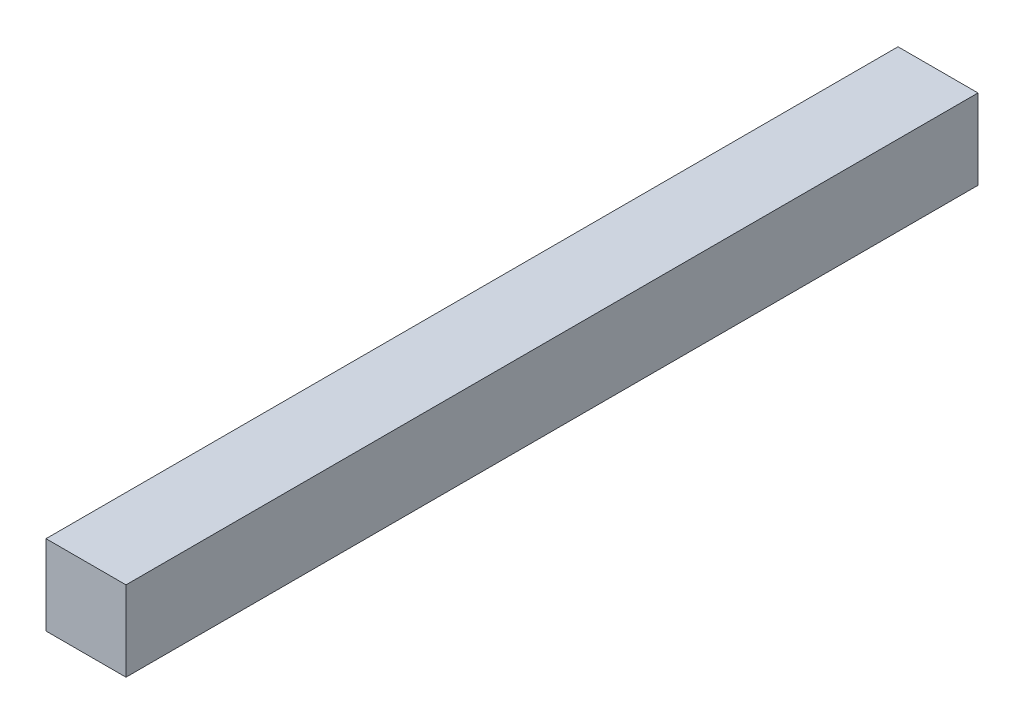
ISO-10303-21;
HEADER;
FILE_DESCRIPTION(('STEP AP214'),'2;1');
FILE_NAME('part.step','',(''),(''),'','','');
FILE_SCHEMA(('AUTOMOTIVE_DESIGN { 1 0 10303 214 1 1 1 1 }'));
ENDSEC;
DATA;
#1=APPLICATION_CONTEXT('core data for automotive mechanical design processes');
#2=APPLICATION_PROTOCOL_DEFINITION('international standard','automotive_design',2000,#1);
#3=PRODUCT_CONTEXT('',#1,'mechanical');
#4=PRODUCT('Part','Part','',(#3));
#5=PRODUCT_RELATED_PRODUCT_CATEGORY('part','',(#4));
#6=PRODUCT_DEFINITION_FORMATION('','',#4);
#7=PRODUCT_DEFINITION_CONTEXT('part definition',#1,'design');
#8=PRODUCT_DEFINITION('design','',#6,#7);
#9=PRODUCT_DEFINITION_SHAPE('','',#8);
#10=(LENGTH_UNIT() NAMED_UNIT(*) SI_UNIT(.MILLI.,.METRE.));
#11=(NAMED_UNIT(*) PLANE_ANGLE_UNIT() SI_UNIT($,.RADIAN.));
#12=(NAMED_UNIT(*) SI_UNIT($,.STERADIAN.) SOLID_ANGLE_UNIT());
#13=UNCERTAINTY_MEASURE_WITH_UNIT(LENGTH_MEASURE(1.E-05),#10,'distance_accuracy_value','');
#14=(GEOMETRIC_REPRESENTATION_CONTEXT(3) GLOBAL_UNCERTAINTY_ASSIGNED_CONTEXT((#13)) GLOBAL_UNIT_ASSIGNED_CONTEXT((#10,
#11,#12)) REPRESENTATION_CONTEXT('',''));
#15=CARTESIAN_POINT('',(0.,0.,0.));
#16=DIRECTION('',(0.,0.,1.));
#17=DIRECTION('',(1.,0.,0.));
#18=AXIS2_PLACEMENT_3D('',#15,#16,#17);
#19=CARTESIAN_POINT('',(0.,-2.539999996998E-06,0.));
#20=DIRECTION('',(-1.,0.,0.));
#21=DIRECTION('',(0.,0.,1.));
#22=AXIS2_PLACEMENT_3D('',#19,#20,#21);
#23=PLANE('',#22);
#24=DIRECTION('',(0.,0.,-1.));
#25=VECTOR('',#24,1.);
#26=CARTESIAN_POINT('',(0.,0.009999980000003,0.));
#27=LINE('',#26,#25);
#28=CARTESIAN_POINT('',(0.,0.009999980000003,0.10651998));
#29=VERTEX_POINT('',#28);
#30=CARTESIAN_POINT('',(0.,0.009999980000003,0.));
#31=VERTEX_POINT('',#30);
#32=EDGE_CURVE('E20',#29,#31,#27,.T.);
#33=ORIENTED_EDGE('',*,*,#32,.T.);
#34=DIRECTION('',(0.,-1.,0.));
#35=VECTOR('',#34,1.);
#36=CARTESIAN_POINT('',(0.,-2.539999996998E-06,0.));
#37=LINE('',#36,#35);
#38=CARTESIAN_POINT('',(0.,-2.539999996998E-06,0.));
#39=VERTEX_POINT('',#38);
#40=EDGE_CURVE('E11',#31,#39,#37,.T.);
#41=ORIENTED_EDGE('',*,*,#40,.T.);
#42=DIRECTION('',(0.,0.,1.));
#43=VECTOR('',#42,1.);
#44=CARTESIAN_POINT('',(0.,-2.539999996998E-06,0.));
#45=LINE('',#44,#43);
#46=CARTESIAN_POINT('',(0.,-2.539999996998E-06,0.10651998));
#47=VERTEX_POINT('',#46);
#48=EDGE_CURVE('E78',#39,#47,#45,.T.);
#49=ORIENTED_EDGE('',*,*,#48,.T.);
#50=DIRECTION('',(0.,1.,0.));
#51=VECTOR('',#50,1.);
#52=CARTESIAN_POINT('',(0.,-2.539999996998E-06,0.10651998));
#53=LINE('',#52,#51);
#54=EDGE_CURVE('E61',#47,#29,#53,.T.);
#55=ORIENTED_EDGE('',*,*,#54,.T.);
#56=EDGE_LOOP('',(#33,#41,#49,#55));
#57=FACE_BOUND('',#56,.T.);
#58=ADVANCED_FACE('F17',(#57),#23,.T.);
#59=CARTESIAN_POINT('',(0.,-2.539999996998E-06,0.));
#60=DIRECTION('',(0.,0.,1.));
#61=DIRECTION('',(1.,0.,0.));
#62=AXIS2_PLACEMENT_3D('',#59,#60,#61);
#63=PLANE('',#62);
#64=DIRECTION('',(-1.,0.,0.));
#65=VECTOR('',#64,1.);
#66=CARTESIAN_POINT('',(0.,0.009999980000003,0.));
#67=LINE('',#66,#65);
#68=CARTESIAN_POINT('',(0.009999980000003,0.009999980000003,0.));
#69=VERTEX_POINT('',#68);
#70=EDGE_CURVE('E71',#69,#31,#67,.T.);
#71=ORIENTED_EDGE('',*,*,#70,.F.);
#72=DIRECTION('',(0.,1.,0.));
#73=VECTOR('',#72,1.);
#74=CARTESIAN_POINT('',(0.009999980000003,-2.539999996998E-06,0.));
#75=LINE('',#74,#73);
#76=CARTESIAN_POINT('',(0.009999980000003,-2.539999996998E-06,0.));
#77=VERTEX_POINT('',#76);
#78=EDGE_CURVE('E98',#77,#69,#75,.T.);
#79=ORIENTED_EDGE('',*,*,#78,.F.);
#80=DIRECTION('',(1.,0.,0.));
#81=VECTOR('',#80,1.);
#82=CARTESIAN_POINT('',(0.,-2.539999996998E-06,0.));
#83=LINE('',#82,#81);
#84=EDGE_CURVE('E82',#39,#77,#83,.T.);
#85=ORIENTED_EDGE('',*,*,#84,.F.);
#86=ORIENTED_EDGE('',*,*,#40,.F.);
#87=EDGE_LOOP('',(#71,#79,#85,#86));
#88=FACE_BOUND('',#87,.T.);
#89=ADVANCED_FACE('F165',(#88),#63,.F.);
#90=CARTESIAN_POINT('',(0.,0.009999980000003,0.));
#91=DIRECTION('',(0.,1.,0.));
#92=DIRECTION('',(1.,0.,0.));
#93=AXIS2_PLACEMENT_3D('',#90,#91,#92);
#94=PLANE('',#93);
#95=DIRECTION('',(0.,0.,-1.));
#96=VECTOR('',#95,1.);
#97=CARTESIAN_POINT('',(0.009999980000003,0.009999980000003,0.));
#98=LINE('',#97,#96);
#99=CARTESIAN_POINT('',(0.009999980000003,0.009999980000003,0.10651998));
#100=VERTEX_POINT('',#99);
#101=EDGE_CURVE('E92',#100,#69,#98,.T.);
#102=ORIENTED_EDGE('',*,*,#101,.T.);
#103=ORIENTED_EDGE('',*,*,#70,.T.);
#104=ORIENTED_EDGE('',*,*,#32,.F.);
#105=DIRECTION('',(1.,0.,0.));
#106=VECTOR('',#105,1.);
#107=CARTESIAN_POINT('',(0.,0.009999980000003,0.10651998));
#108=LINE('',#107,#106);
#109=EDGE_CURVE('E67',#29,#100,#108,.T.);
#110=ORIENTED_EDGE('',*,*,#109,.T.);
#111=EDGE_LOOP('',(#102,#103,#104,#110));
#112=FACE_BOUND('',#111,.T.);
#113=ADVANCED_FACE('F160',(#112),#94,.T.);
#114=CARTESIAN_POINT('',(0.,-2.539999996998E-06,0.10651998));
#115=DIRECTION('',(0.,0.,1.));
#116=DIRECTION('',(1.,0.,0.));
#117=AXIS2_PLACEMENT_3D('',#114,#115,#116);
#118=PLANE('',#117);
#119=ORIENTED_EDGE('',*,*,#109,.F.);
#120=ORIENTED_EDGE('',*,*,#54,.F.);
#121=DIRECTION('',(1.,0.,0.));
#122=VECTOR('',#121,1.);
#123=CARTESIAN_POINT('',(0.,-2.539999996998E-06,0.10651998));
#124=LINE('',#123,#122);
#125=CARTESIAN_POINT('',(0.009999980000003,-2.539999996998E-06,0.10651998));
#126=VERTEX_POINT('',#125);
#127=EDGE_CURVE('E65',#47,#126,#124,.T.);
#128=ORIENTED_EDGE('',*,*,#127,.T.);
#129=DIRECTION('',(0.,1.,0.));
#130=VECTOR('',#129,1.);
#131=CARTESIAN_POINT('',(0.009999980000003,-2.539999996998E-06,0.10651998));
#132=LINE('',#131,#130);
#133=EDGE_CURVE('E84',#126,#100,#132,.T.);
#134=ORIENTED_EDGE('',*,*,#133,.T.);
#135=EDGE_LOOP('',(#119,#120,#128,#134));
#136=FACE_BOUND('',#135,.T.);
#137=ADVANCED_FACE('F63',(#136),#118,.T.);
#138=CARTESIAN_POINT('',(0.009999980000003,-2.539999996998E-06,0.));
#139=DIRECTION('',(0.,-1.,0.));
#140=DIRECTION('',(0.,0.,-1.));
#141=AXIS2_PLACEMENT_3D('',#138,#139,#140);
#142=PLANE('',#141);
#143=ORIENTED_EDGE('',*,*,#48,.F.);
#144=ORIENTED_EDGE('',*,*,#84,.T.);
#145=DIRECTION('',(0.,0.,1.));
#146=VECTOR('',#145,1.);
#147=CARTESIAN_POINT('',(0.009999980000003,-2.539999996998E-06,0.));
#148=LINE('',#147,#146);
#149=EDGE_CURVE('E80',#77,#126,#148,.T.);
#150=ORIENTED_EDGE('',*,*,#149,.T.);
#151=ORIENTED_EDGE('',*,*,#127,.F.);
#152=EDGE_LOOP('',(#143,#144,#150,#151));
#153=FACE_BOUND('',#152,.T.);
#154=ADVANCED_FACE('F76',(#153),#142,.T.);
#155=CARTESIAN_POINT('',(0.009999980000003,0.009999980000003,0.));
#156=DIRECTION('',(1.,0.,0.));
#157=DIRECTION('',(0.,1.,0.));
#158=AXIS2_PLACEMENT_3D('',#155,#156,#157);
#159=PLANE('',#158);
#160=ORIENTED_EDGE('',*,*,#149,.F.);
#161=ORIENTED_EDGE('',*,*,#78,.T.);
#162=ORIENTED_EDGE('',*,*,#101,.F.);
#163=ORIENTED_EDGE('',*,*,#133,.F.);
#164=EDGE_LOOP('',(#160,#161,#162,#163));
#165=FACE_BOUND('',#164,.T.);
#166=ADVANCED_FACE('F140',(#165),#159,.T.);
#167=CLOSED_SHELL('',(#58,#89,#113,#137,#154,#166));
#168=MANIFOLD_SOLID_BREP('B1',#167);
#169=ADVANCED_BREP_SHAPE_REPRESENTATION('',(#18,#168),#14);
#170=SHAPE_DEFINITION_REPRESENTATION(#9,#169);
ENDSEC;
END-ISO-10303-21;
